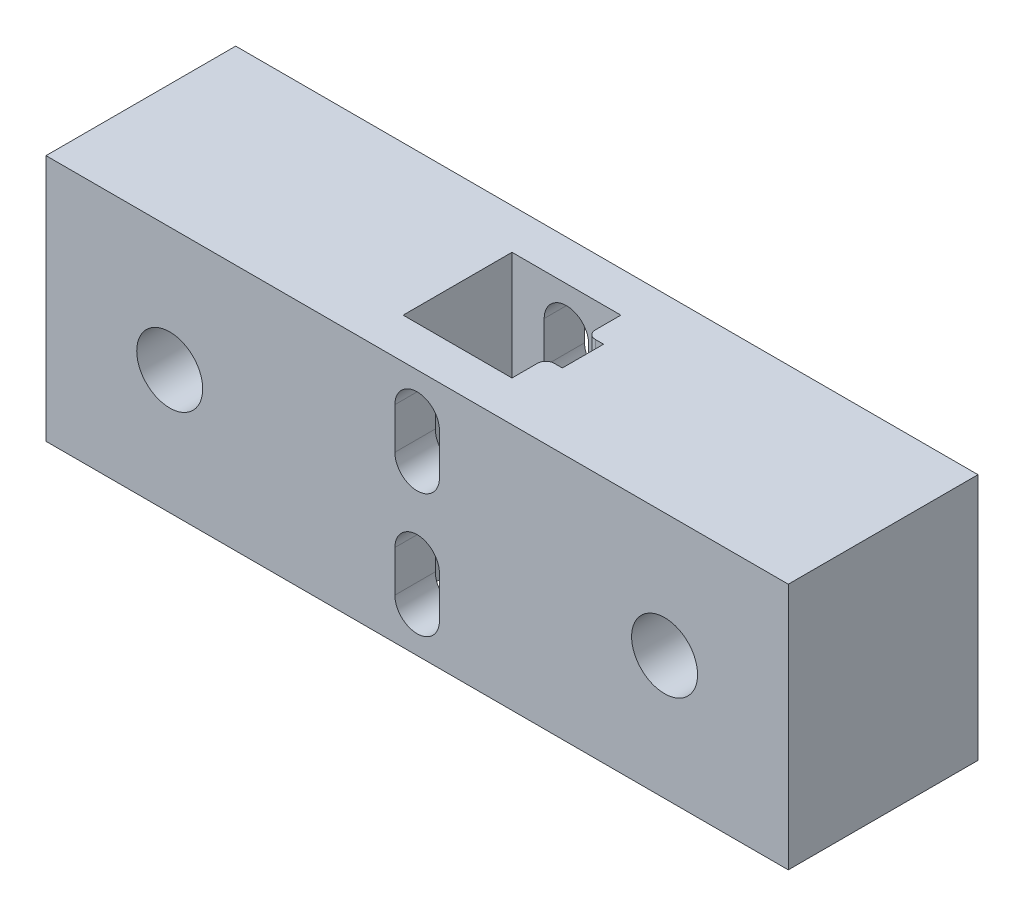
ISO-10303-21;
HEADER;
FILE_DESCRIPTION(('STEP AP214'),'2;1');
FILE_NAME('part.step','',(''),(''),'','','');
FILE_SCHEMA(('AUTOMOTIVE_DESIGN { 1 0 10303 214 1 1 1 1 }'));
ENDSEC;
DATA;
#1=APPLICATION_CONTEXT('core data for automotive mechanical design processes');
#2=APPLICATION_PROTOCOL_DEFINITION('international standard','automotive_design',2000,#1);
#3=PRODUCT_CONTEXT('',#1,'mechanical');
#4=PRODUCT('Part','Part','',(#3));
#5=PRODUCT_RELATED_PRODUCT_CATEGORY('part','',(#4));
#6=PRODUCT_DEFINITION_FORMATION('','',#4);
#7=PRODUCT_DEFINITION_CONTEXT('part definition',#1,'design');
#8=PRODUCT_DEFINITION('design','',#6,#7);
#9=PRODUCT_DEFINITION_SHAPE('','',#8);
#10=(LENGTH_UNIT() NAMED_UNIT(*) SI_UNIT(.MILLI.,.METRE.));
#11=(NAMED_UNIT(*) PLANE_ANGLE_UNIT() SI_UNIT($,.RADIAN.));
#12=(NAMED_UNIT(*) SI_UNIT($,.STERADIAN.) SOLID_ANGLE_UNIT());
#13=UNCERTAINTY_MEASURE_WITH_UNIT(LENGTH_MEASURE(1.E-05),#10,'distance_accuracy_value','');
#14=(GEOMETRIC_REPRESENTATION_CONTEXT(3) GLOBAL_UNCERTAINTY_ASSIGNED_CONTEXT((#13)) GLOBAL_UNIT_ASSIGNED_CONTEXT((#10,
#11,#12)) REPRESENTATION_CONTEXT('',''));
#15=CARTESIAN_POINT('',(0.,0.,0.));
#16=DIRECTION('',(0.,0.,1.));
#17=DIRECTION('',(1.,0.,0.));
#18=AXIS2_PLACEMENT_3D('',#15,#16,#17);
#19=CARTESIAN_POINT('',(0.,0.,23.));
#20=DIRECTION('',(0.,0.,1.));
#21=DIRECTION('',(1.,0.,0.));
#22=AXIS2_PLACEMENT_3D('',#19,#20,#21);
#23=PLANE('',#22);
#24=CARTESIAN_POINT('',(40.889968792194,-23.0911366711773,23.));
#25=DIRECTION('',(0.,0.,-1.));
#26=DIRECTION('',(-1.,0.,0.));
#27=AXIS2_PLACEMENT_3D('',#24,#25,#26);
#28=CIRCLE('',#27,2.69999999999999);
#29=CARTESIAN_POINT('',(43.589968792194,-23.0911366711773,23.));
#30=VERTEX_POINT('',#29);
#31=CARTESIAN_POINT('',(38.1899687921941,-23.0911366711773,23.));
#32=VERTEX_POINT('',#31);
#33=EDGE_CURVE('E303',#30,#32,#28,.T.);
#34=ORIENTED_EDGE('',*,*,#33,.T.);
#35=DIRECTION('',(0.,1.,0.));
#36=VECTOR('',#35,1.);
#37=CARTESIAN_POINT('',(38.1899687921941,-23.0911366711773,23.));
#38=LINE('',#37,#36);
#39=CARTESIAN_POINT('',(38.1899687921941,-18.0911366711773,23.));
#40=VERTEX_POINT('',#39);
#41=EDGE_CURVE('E314',#32,#40,#38,.T.);
#42=ORIENTED_EDGE('',*,*,#41,.T.);
#43=CARTESIAN_POINT('',(40.889968792194,-18.0911366711773,23.));
#44=DIRECTION('',(0.,0.,-1.));
#45=DIRECTION('',(-1.,0.,0.));
#46=AXIS2_PLACEMENT_3D('',#43,#44,#45);
#47=CIRCLE('',#46,2.69999999999999);
#48=CARTESIAN_POINT('',(43.589968792194,-18.0911366711773,23.));
#49=VERTEX_POINT('',#48);
#50=EDGE_CURVE('E311',#40,#49,#47,.T.);
#51=ORIENTED_EDGE('',*,*,#50,.T.);
#52=DIRECTION('',(0.,1.,0.));
#53=VECTOR('',#52,1.);
#54=CARTESIAN_POINT('',(43.589968792194,-23.0911366711773,23.));
#55=LINE('',#54,#53);
#56=EDGE_CURVE('E285',#30,#49,#55,.T.);
#57=ORIENTED_EDGE('',*,*,#56,.F.);
#58=EDGE_LOOP('',(#34,#42,#51,#57));
#59=FACE_BOUND('',#58,.T.);
#60=CARTESIAN_POINT('',(70.889968792194,-13.0911366711773,23.));
#61=DIRECTION('',(0.,0.,1.));
#62=DIRECTION('',(1.,0.,0.));
#63=AXIS2_PLACEMENT_3D('',#60,#61,#62);
#64=CIRCLE('',#63,4.00000000000001);
#65=CARTESIAN_POINT('',(74.8899687921941,-13.0911366711773,23.));
#66=VERTEX_POINT('',#65);
#67=EDGE_CURVE('E339',#66,#66,#64,.T.);
#68=ORIENTED_EDGE('',*,*,#67,.F.);
#69=EDGE_LOOP('',(#68));
#70=FACE_BOUND('',#69,.T.);
#71=DIRECTION('',(0.,-1.,0.));
#72=VECTOR('',#71,1.);
#73=CARTESIAN_POINT('',(-4.11003120780596,1.90886332882273,23.));
#74=LINE('',#73,#72);
#75=CARTESIAN_POINT('',(-4.11003120780596,1.90886332882273,23.));
#76=VERTEX_POINT('',#75);
#77=CARTESIAN_POINT('',(-4.11003120780596,-28.0911366711773,23.));
#78=VERTEX_POINT('',#77);
#79=EDGE_CURVE('E405',#76,#78,#74,.T.);
#80=ORIENTED_EDGE('',*,*,#79,.T.);
#81=DIRECTION('',(1.,0.,0.));
#82=VECTOR('',#81,1.);
#83=CARTESIAN_POINT('',(-4.11003120780596,-28.0911366711773,23.));
#84=LINE('',#83,#82);
#85=CARTESIAN_POINT('',(85.889968792194,-28.0911366711773,23.));
#86=VERTEX_POINT('',#85);
#87=EDGE_CURVE('E408',#78,#86,#84,.T.);
#88=ORIENTED_EDGE('',*,*,#87,.T.);
#89=DIRECTION('',(0.,1.,0.));
#90=VECTOR('',#89,1.);
#91=CARTESIAN_POINT('',(85.889968792194,1.90886332882273,23.));
#92=LINE('',#91,#90);
#93=CARTESIAN_POINT('',(85.889968792194,1.90886332882273,23.));
#94=VERTEX_POINT('',#93);
#95=EDGE_CURVE('E411',#86,#94,#92,.T.);
#96=ORIENTED_EDGE('',*,*,#95,.T.);
#97=DIRECTION('',(-1.,0.,0.));
#98=VECTOR('',#97,1.);
#99=CARTESIAN_POINT('',(-4.11003120780596,1.90886332882273,23.));
#100=LINE('',#99,#98);
#101=EDGE_CURVE('E413',#94,#76,#100,.T.);
#102=ORIENTED_EDGE('',*,*,#101,.T.);
#103=EDGE_LOOP('',(#80,#88,#96,#102));
#104=FACE_BOUND('',#103,.T.);
#105=CARTESIAN_POINT('',(10.889968792194,-13.0911366711773,23.));
#106=DIRECTION('',(0.,0.,-1.));
#107=DIRECTION('',(-1.,0.,0.));
#108=AXIS2_PLACEMENT_3D('',#105,#106,#107);
#109=CIRCLE('',#108,4.);
#110=CARTESIAN_POINT('',(6.88996879219403,-13.0911366711773,23.));
#111=VERTEX_POINT('',#110);
#112=EDGE_CURVE('E340',#111,#111,#109,.T.);
#113=ORIENTED_EDGE('',*,*,#112,.T.);
#114=EDGE_LOOP('',(#113));
#115=FACE_BOUND('',#114,.T.);
#116=DIRECTION('',(0.,-1.,0.));
#117=VECTOR('',#116,1.);
#118=CARTESIAN_POINT('',(43.589968792194,0.,23.));
#119=LINE('',#118,#117);
#120=CARTESIAN_POINT('',(43.589968792194,-3.09113667117727,23.));
#121=VERTEX_POINT('',#120);
#122=CARTESIAN_POINT('',(43.589968792194,-8.09113667117727,23.));
#123=VERTEX_POINT('',#122);
#124=EDGE_CURVE('E256',#121,#123,#119,.T.);
#125=ORIENTED_EDGE('',*,*,#124,.T.);
#126=CARTESIAN_POINT('',(40.889968792194,-8.09113667117727,23.));
#127=DIRECTION('',(0.,0.,-1.));
#128=DIRECTION('',(-1.,0.,0.));
#129=AXIS2_PLACEMENT_3D('',#126,#127,#128);
#130=CIRCLE('',#129,2.69999999999999);
#131=CARTESIAN_POINT('',(38.1899687921941,-8.09113667117727,23.));
#132=VERTEX_POINT('',#131);
#133=EDGE_CURVE('E242',#132,#123,#130,.F.);
#134=ORIENTED_EDGE('',*,*,#133,.F.);
#135=DIRECTION('',(0.,-1.,0.));
#136=VECTOR('',#135,1.);
#137=CARTESIAN_POINT('',(38.1899687921941,0.,23.));
#138=LINE('',#137,#136);
#139=CARTESIAN_POINT('',(38.1899687921941,-3.09113667117727,23.));
#140=VERTEX_POINT('',#139);
#141=EDGE_CURVE('E230',#140,#132,#138,.T.);
#142=ORIENTED_EDGE('',*,*,#141,.F.);
#143=CARTESIAN_POINT('',(40.889968792194,-3.09113667117727,23.));
#144=DIRECTION('',(0.,0.,-1.));
#145=DIRECTION('',(-1.,0.,0.));
#146=AXIS2_PLACEMENT_3D('',#143,#144,#145);
#147=CIRCLE('',#146,2.69999999999999);
#148=EDGE_CURVE('E241',#121,#140,#147,.F.);
#149=ORIENTED_EDGE('',*,*,#148,.F.);
#150=EDGE_LOOP('',(#125,#134,#142,#149));
#151=FACE_BOUND('',#150,.T.);
#152=ADVANCED_FACE('F35',(#59,#70,#104,#115,#151),#23,.T.);
#153=CARTESIAN_POINT('',(0.,0.,0.));
#154=DIRECTION('',(0.,0.,1.));
#155=DIRECTION('',(1.,0.,0.));
#156=AXIS2_PLACEMENT_3D('',#153,#154,#155);
#157=PLANE('',#156);
#158=CARTESIAN_POINT('',(10.889968792194,-13.0911366711773,0.));
#159=DIRECTION('',(0.,0.,-1.));
#160=DIRECTION('',(-1.,0.,0.));
#161=AXIS2_PLACEMENT_3D('',#158,#159,#160);
#162=CIRCLE('',#161,4.);
#163=CARTESIAN_POINT('',(6.88996879219403,-13.0911366711773,0.));
#164=VERTEX_POINT('',#163);
#165=EDGE_CURVE('E344',#164,#164,#162,.T.);
#166=ORIENTED_EDGE('',*,*,#165,.F.);
#167=EDGE_LOOP('',(#166));
#168=FACE_BOUND('',#167,.T.);
#169=CARTESIAN_POINT('',(70.889968792194,-13.0911366711773,0.));
#170=DIRECTION('',(0.,0.,1.));
#171=DIRECTION('',(1.,0.,0.));
#172=AXIS2_PLACEMENT_3D('',#169,#170,#171);
#173=CIRCLE('',#172,4.00000000000001);
#174=CARTESIAN_POINT('',(74.8899687921941,-13.0911366711773,0.));
#175=VERTEX_POINT('',#174);
#176=EDGE_CURVE('E347',#175,#175,#173,.T.);
#177=ORIENTED_EDGE('',*,*,#176,.T.);
#178=EDGE_LOOP('',(#177));
#179=FACE_BOUND('',#178,.T.);
#180=DIRECTION('',(0.,-1.,0.));
#181=VECTOR('',#180,1.);
#182=CARTESIAN_POINT('',(-4.11003120780596,1.90886332882273,0.));
#183=LINE('',#182,#181);
#184=CARTESIAN_POINT('',(-4.11003120780596,1.90886332882273,0.));
#185=VERTEX_POINT('',#184);
#186=CARTESIAN_POINT('',(-4.11003120780596,-28.0911366711773,0.));
#187=VERTEX_POINT('',#186);
#188=EDGE_CURVE('E390',#185,#187,#183,.T.);
#189=ORIENTED_EDGE('',*,*,#188,.F.);
#190=DIRECTION('',(-1.,0.,0.));
#191=VECTOR('',#190,1.);
#192=CARTESIAN_POINT('',(-4.11003120780596,1.90886332882273,0.));
#193=LINE('',#192,#191);
#194=CARTESIAN_POINT('',(85.889968792194,1.90886332882273,0.));
#195=VERTEX_POINT('',#194);
#196=EDGE_CURVE('E409',#195,#185,#193,.T.);
#197=ORIENTED_EDGE('',*,*,#196,.F.);
#198=DIRECTION('',(0.,1.,0.));
#199=VECTOR('',#198,1.);
#200=CARTESIAN_POINT('',(85.889968792194,1.90886332882273,0.));
#201=LINE('',#200,#199);
#202=CARTESIAN_POINT('',(85.889968792194,-28.0911366711773,0.));
#203=VERTEX_POINT('',#202);
#204=EDGE_CURVE('E420',#203,#195,#201,.T.);
#205=ORIENTED_EDGE('',*,*,#204,.F.);
#206=DIRECTION('',(1.,0.,0.));
#207=VECTOR('',#206,1.);
#208=CARTESIAN_POINT('',(-4.11003120780596,-28.0911366711773,0.));
#209=LINE('',#208,#207);
#210=EDGE_CURVE('E418',#187,#203,#209,.T.);
#211=ORIENTED_EDGE('',*,*,#210,.F.);
#212=EDGE_LOOP('',(#189,#197,#205,#211));
#213=FACE_BOUND('',#212,.T.);
#214=DIRECTION('',(0.,1.,0.));
#215=VECTOR('',#214,1.);
#216=CARTESIAN_POINT('',(38.1899687921941,-23.0911366711773,0.));
#217=LINE('',#216,#215);
#218=CARTESIAN_POINT('',(38.1899687921941,-23.0911366711773,0.));
#219=VERTEX_POINT('',#218);
#220=CARTESIAN_POINT('',(38.1899687921941,-18.0911366711773,0.));
#221=VERTEX_POINT('',#220);
#222=EDGE_CURVE('E306',#219,#221,#217,.T.);
#223=ORIENTED_EDGE('',*,*,#222,.F.);
#224=CARTESIAN_POINT('',(40.889968792194,-23.0911366711773,0.));
#225=DIRECTION('',(0.,0.,-1.));
#226=DIRECTION('',(-1.,0.,0.));
#227=AXIS2_PLACEMENT_3D('',#224,#225,#226);
#228=CIRCLE('',#227,2.69999999999999);
#229=CARTESIAN_POINT('',(43.589968792194,-23.0911366711773,0.));
#230=VERTEX_POINT('',#229);
#231=EDGE_CURVE('E269',#230,#219,#228,.T.);
#232=ORIENTED_EDGE('',*,*,#231,.F.);
#233=DIRECTION('',(0.,1.,0.));
#234=VECTOR('',#233,1.);
#235=CARTESIAN_POINT('',(43.589968792194,-23.0911366711773,0.));
#236=LINE('',#235,#234);
#237=CARTESIAN_POINT('',(43.589968792194,-18.0911366711773,0.));
#238=VERTEX_POINT('',#237);
#239=EDGE_CURVE('E299',#230,#238,#236,.T.);
#240=ORIENTED_EDGE('',*,*,#239,.T.);
#241=CARTESIAN_POINT('',(40.889968792194,-18.0911366711773,0.));
#242=DIRECTION('',(0.,0.,-1.));
#243=DIRECTION('',(-1.,0.,0.));
#244=AXIS2_PLACEMENT_3D('',#241,#242,#243);
#245=CIRCLE('',#244,2.69999999999999);
#246=EDGE_CURVE('E302',#221,#238,#245,.T.);
#247=ORIENTED_EDGE('',*,*,#246,.F.);
#248=EDGE_LOOP('',(#223,#232,#240,#247));
#249=FACE_BOUND('',#248,.T.);
#250=CARTESIAN_POINT('',(40.889968792194,-8.09113667117727,0.));
#251=DIRECTION('',(0.,0.,-1.));
#252=DIRECTION('',(-1.,0.,0.));
#253=AXIS2_PLACEMENT_3D('',#250,#251,#252);
#254=CIRCLE('',#253,2.69999999999999);
#255=CARTESIAN_POINT('',(38.1899687921941,-8.09113667117727,0.));
#256=VERTEX_POINT('',#255);
#257=CARTESIAN_POINT('',(43.589968792194,-8.09113667117727,0.));
#258=VERTEX_POINT('',#257);
#259=EDGE_CURVE('E265',#256,#258,#254,.F.);
#260=ORIENTED_EDGE('',*,*,#259,.T.);
#261=DIRECTION('',(0.,-1.,0.));
#262=VECTOR('',#261,1.);
#263=CARTESIAN_POINT('',(43.589968792194,0.,0.));
#264=LINE('',#263,#262);
#265=CARTESIAN_POINT('',(43.589968792194,-3.09113667117727,0.));
#266=VERTEX_POINT('',#265);
#267=EDGE_CURVE('E257',#266,#258,#264,.T.);
#268=ORIENTED_EDGE('',*,*,#267,.F.);
#269=CARTESIAN_POINT('',(40.889968792194,-3.09113667117727,0.));
#270=DIRECTION('',(0.,0.,-1.));
#271=DIRECTION('',(-1.,0.,0.));
#272=AXIS2_PLACEMENT_3D('',#269,#270,#271);
#273=CIRCLE('',#272,2.69999999999999);
#274=CARTESIAN_POINT('',(38.1899687921941,-3.09113667117727,0.));
#275=VERTEX_POINT('',#274);
#276=EDGE_CURVE('E260',#266,#275,#273,.F.);
#277=ORIENTED_EDGE('',*,*,#276,.T.);
#278=DIRECTION('',(0.,-1.,0.));
#279=VECTOR('',#278,1.);
#280=CARTESIAN_POINT('',(38.1899687921941,0.,0.));
#281=LINE('',#280,#279);
#282=EDGE_CURVE('E268',#275,#256,#281,.T.);
#283=ORIENTED_EDGE('',*,*,#282,.T.);
#284=EDGE_LOOP('',(#260,#268,#277,#283));
#285=FACE_BOUND('',#284,.T.);
#286=ADVANCED_FACE('F516',(#168,#179,#213,#249,#285),#157,.F.);
#287=CARTESIAN_POINT('',(0.,-28.0911366711773,4.89999999999999));
#288=DIRECTION('',(0.,0.,-1.));
#289=DIRECTION('',(-1.,0.,0.));
#290=AXIS2_PLACEMENT_3D('',#287,#288,#289);
#291=PLANE('',#290);
#292=DIRECTION('',(-1.,0.,0.));
#293=VECTOR('',#292,1.);
#294=CARTESIAN_POINT('',(0.,1.90886332882273,4.89999999999999));
#295=LINE('',#294,#293);
#296=CARTESIAN_POINT('',(47.489968792194,1.90886332882273,4.89999999999999));
#297=VERTEX_POINT('',#296);
#298=CARTESIAN_POINT('',(34.289968792194,1.90886332882273,4.89999999999999));
#299=VERTEX_POINT('',#298);
#300=EDGE_CURVE('E343',#297,#299,#295,.T.);
#301=ORIENTED_EDGE('',*,*,#300,.T.);
#302=DIRECTION('',(0.,1.,0.));
#303=VECTOR('',#302,1.);
#304=CARTESIAN_POINT('',(34.289968792194,-28.0911366711773,4.89999999999999));
#305=LINE('',#304,#303);
#306=CARTESIAN_POINT('',(34.289968792194,-28.0911366711773,4.89999999999999));
#307=VERTEX_POINT('',#306);
#308=EDGE_CURVE('E402',#307,#299,#305,.T.);
#309=ORIENTED_EDGE('',*,*,#308,.F.);
#310=DIRECTION('',(-1.,0.,0.));
#311=VECTOR('',#310,1.);
#312=CARTESIAN_POINT('',(0.,-28.0911366711773,4.89999999999999));
#313=LINE('',#312,#311);
#314=CARTESIAN_POINT('',(47.489968792194,-28.0911366711773,4.89999999999999));
#315=VERTEX_POINT('',#314);
#316=EDGE_CURVE('E352',#315,#307,#313,.T.);
#317=ORIENTED_EDGE('',*,*,#316,.F.);
#318=DIRECTION('',(0.,1.,0.));
#319=VECTOR('',#318,1.);
#320=CARTESIAN_POINT('',(47.489968792194,-28.0911366711773,4.89999999999999));
#321=LINE('',#320,#319);
#322=EDGE_CURVE('E388',#315,#297,#321,.T.);
#323=ORIENTED_EDGE('',*,*,#322,.T.);
#324=EDGE_LOOP('',(#301,#309,#317,#323));
#325=FACE_BOUND('',#324,.T.);
#326=DIRECTION('',(0.,1.,0.));
#327=VECTOR('',#326,1.);
#328=CARTESIAN_POINT('',(43.589968792194,-28.0911366711773,4.89999999999999));
#329=LINE('',#328,#327);
#330=CARTESIAN_POINT('',(43.589968792194,-23.0911366711773,4.89999999999999));
#331=VERTEX_POINT('',#330);
#332=CARTESIAN_POINT('',(43.589968792194,-18.0911366711773,4.89999999999999));
#333=VERTEX_POINT('',#332);
#334=EDGE_CURVE('E324',#331,#333,#329,.T.);
#335=ORIENTED_EDGE('',*,*,#334,.F.);
#336=CARTESIAN_POINT('',(40.889968792194,-23.0911366711773,4.89999999999999));
#337=DIRECTION('',(0.,0.,-1.));
#338=DIRECTION('',(-1.,0.,0.));
#339=AXIS2_PLACEMENT_3D('',#336,#337,#338);
#340=CIRCLE('',#339,2.69999999999999);
#341=CARTESIAN_POINT('',(38.1899687921941,-23.0911366711773,4.89999999999999));
#342=VERTEX_POINT('',#341);
#343=EDGE_CURVE('E326',#331,#342,#340,.T.);
#344=ORIENTED_EDGE('',*,*,#343,.T.);
#345=DIRECTION('',(0.,1.,0.));
#346=VECTOR('',#345,1.);
#347=CARTESIAN_POINT('',(38.1899687921941,-28.0911366711773,4.89999999999999));
#348=LINE('',#347,#346);
#349=CARTESIAN_POINT('',(38.1899687921941,-18.0911366711773,4.89999999999999));
#350=VERTEX_POINT('',#349);
#351=EDGE_CURVE('E276',#342,#350,#348,.T.);
#352=ORIENTED_EDGE('',*,*,#351,.T.);
#353=CARTESIAN_POINT('',(40.889968792194,-18.0911366711773,4.89999999999999));
#354=DIRECTION('',(0.,0.,-1.));
#355=DIRECTION('',(-1.,0.,0.));
#356=AXIS2_PLACEMENT_3D('',#353,#354,#355);
#357=CIRCLE('',#356,2.69999999999999);
#358=EDGE_CURVE('E321',#350,#333,#357,.T.);
#359=ORIENTED_EDGE('',*,*,#358,.T.);
#360=EDGE_LOOP('',(#335,#344,#352,#359));
#361=FACE_BOUND('',#360,.T.);
#362=CARTESIAN_POINT('',(40.889968792194,-8.09113667117727,4.89999999999999));
#363=DIRECTION('',(0.,0.,-1.));
#364=DIRECTION('',(-1.,0.,0.));
#365=AXIS2_PLACEMENT_3D('',#362,#363,#364);
#366=CIRCLE('',#365,2.69999999999999);
#367=CARTESIAN_POINT('',(38.1899687921941,-8.09113667117727,4.89999999999999));
#368=VERTEX_POINT('',#367);
#369=CARTESIAN_POINT('',(43.589968792194,-8.09113667117727,4.89999999999999));
#370=VERTEX_POINT('',#369);
#371=EDGE_CURVE('E337',#368,#370,#366,.F.);
#372=ORIENTED_EDGE('',*,*,#371,.F.);
#373=DIRECTION('',(0.,-1.,0.));
#374=VECTOR('',#373,1.);
#375=CARTESIAN_POINT('',(38.1899687921941,-28.0911366711773,4.89999999999999));
#376=LINE('',#375,#374);
#377=CARTESIAN_POINT('',(38.1899687921941,-3.09113667117727,4.89999999999999));
#378=VERTEX_POINT('',#377);
#379=EDGE_CURVE('E329',#378,#368,#376,.T.);
#380=ORIENTED_EDGE('',*,*,#379,.F.);
#381=CARTESIAN_POINT('',(40.889968792194,-3.09113667117727,4.89999999999999));
#382=DIRECTION('',(0.,0.,-1.));
#383=DIRECTION('',(-1.,0.,0.));
#384=AXIS2_PLACEMENT_3D('',#381,#382,#383);
#385=CIRCLE('',#384,2.69999999999999);
#386=CARTESIAN_POINT('',(43.589968792194,-3.09113667117727,4.89999999999999));
#387=VERTEX_POINT('',#386);
#388=EDGE_CURVE('E331',#387,#378,#385,.F.);
#389=ORIENTED_EDGE('',*,*,#388,.F.);
#390=DIRECTION('',(0.,-1.,0.));
#391=VECTOR('',#390,1.);
#392=CARTESIAN_POINT('',(43.589968792194,-28.0911366711773,4.89999999999999));
#393=LINE('',#392,#391);
#394=EDGE_CURVE('E334',#387,#370,#393,.T.);
#395=ORIENTED_EDGE('',*,*,#394,.T.);
#396=EDGE_LOOP('',(#372,#380,#389,#395));
#397=FACE_BOUND('',#396,.T.);
#398=ADVANCED_FACE('F497',(#325,#361,#397),#291,.F.);
#399=CARTESIAN_POINT('',(0.,-28.0911366711773,18.1));
#400=DIRECTION('',(0.,0.,-1.));
#401=DIRECTION('',(-1.,0.,0.));
#402=AXIS2_PLACEMENT_3D('',#399,#400,#401);
#403=PLANE('',#402);
#404=CARTESIAN_POINT('',(40.889968792194,-23.0911366711773,18.1));
#405=DIRECTION('',(0.,0.,-1.));
#406=DIRECTION('',(-1.,0.,0.));
#407=AXIS2_PLACEMENT_3D('',#404,#405,#406);
#408=CIRCLE('',#407,2.69999999999999);
#409=CARTESIAN_POINT('',(43.589968792194,-23.0911366711773,18.1));
#410=VERTEX_POINT('',#409);
#411=CARTESIAN_POINT('',(38.1899687921941,-23.0911366711773,18.1));
#412=VERTEX_POINT('',#411);
#413=EDGE_CURVE('E441',#410,#412,#408,.T.);
#414=ORIENTED_EDGE('',*,*,#413,.F.);
#415=DIRECTION('',(0.,1.,0.));
#416=VECTOR('',#415,1.);
#417=CARTESIAN_POINT('',(43.589968792194,-28.0911366711773,18.1));
#418=LINE('',#417,#416);
#419=CARTESIAN_POINT('',(43.589968792194,-18.0911366711773,18.1));
#420=VERTEX_POINT('',#419);
#421=EDGE_CURVE('E438',#410,#420,#418,.T.);
#422=ORIENTED_EDGE('',*,*,#421,.T.);
#423=CARTESIAN_POINT('',(40.889968792194,-18.0911366711773,18.1));
#424=DIRECTION('',(0.,0.,-1.));
#425=DIRECTION('',(-1.,0.,0.));
#426=AXIS2_PLACEMENT_3D('',#423,#424,#425);
#427=CIRCLE('',#426,2.69999999999999);
#428=CARTESIAN_POINT('',(38.1899687921941,-18.0911366711773,18.1));
#429=VERTEX_POINT('',#428);
#430=EDGE_CURVE('E436',#429,#420,#427,.T.);
#431=ORIENTED_EDGE('',*,*,#430,.F.);
#432=DIRECTION('',(0.,1.,0.));
#433=VECTOR('',#432,1.);
#434=CARTESIAN_POINT('',(38.1899687921941,-28.0911366711773,18.1));
#435=LINE('',#434,#433);
#436=EDGE_CURVE('E434',#412,#429,#435,.T.);
#437=ORIENTED_EDGE('',*,*,#436,.F.);
#438=EDGE_LOOP('',(#414,#422,#431,#437));
#439=FACE_BOUND('',#438,.T.);
#440=DIRECTION('',(-1.,0.,0.));
#441=VECTOR('',#440,1.);
#442=CARTESIAN_POINT('',(0.,1.90886332882273,18.1));
#443=LINE('',#442,#441);
#444=CARTESIAN_POINT('',(47.489968792194,1.90886332882273,18.1));
#445=VERTEX_POINT('',#444);
#446=CARTESIAN_POINT('',(34.289968792194,1.90886332882273,18.1));
#447=VERTEX_POINT('',#446);
#448=EDGE_CURVE('E376',#445,#447,#443,.T.);
#449=ORIENTED_EDGE('',*,*,#448,.F.);
#450=DIRECTION('',(0.,1.,0.));
#451=VECTOR('',#450,1.);
#452=CARTESIAN_POINT('',(47.489968792194,-28.0911366711773,18.1));
#453=LINE('',#452,#451);
#454=CARTESIAN_POINT('',(47.489968792194,-28.0911366711773,18.1));
#455=VERTEX_POINT('',#454);
#456=EDGE_CURVE('E397',#455,#445,#453,.T.);
#457=ORIENTED_EDGE('',*,*,#456,.F.);
#458=DIRECTION('',(-1.,0.,0.));
#459=VECTOR('',#458,1.);
#460=CARTESIAN_POINT('',(0.,-28.0911366711773,18.1));
#461=LINE('',#460,#459);
#462=CARTESIAN_POINT('',(34.289968792194,-28.0911366711773,18.1));
#463=VERTEX_POINT('',#462);
#464=EDGE_CURVE('E359',#455,#463,#461,.T.);
#465=ORIENTED_EDGE('',*,*,#464,.T.);
#466=DIRECTION('',(0.,1.,0.));
#467=VECTOR('',#466,1.);
#468=CARTESIAN_POINT('',(34.289968792194,-28.0911366711773,18.1));
#469=LINE('',#468,#467);
#470=EDGE_CURVE('E400',#463,#447,#469,.T.);
#471=ORIENTED_EDGE('',*,*,#470,.T.);
#472=EDGE_LOOP('',(#449,#457,#465,#471));
#473=FACE_BOUND('',#472,.T.);
#474=DIRECTION('',(0.,-1.,0.));
#475=VECTOR('',#474,1.);
#476=CARTESIAN_POINT('',(38.1899687921941,-28.0911366711773,18.1));
#477=LINE('',#476,#475);
#478=CARTESIAN_POINT('',(38.1899687921941,-3.09113667117727,18.1));
#479=VERTEX_POINT('',#478);
#480=CARTESIAN_POINT('',(38.1899687921941,-8.09113667117727,18.1));
#481=VERTEX_POINT('',#480);
#482=EDGE_CURVE('E444',#479,#481,#477,.T.);
#483=ORIENTED_EDGE('',*,*,#482,.T.);
#484=CARTESIAN_POINT('',(40.889968792194,-8.09113667117727,18.1));
#485=DIRECTION('',(0.,0.,-1.));
#486=DIRECTION('',(-1.,0.,0.));
#487=AXIS2_PLACEMENT_3D('',#484,#485,#486);
#488=CIRCLE('',#487,2.69999999999999);
#489=CARTESIAN_POINT('',(43.589968792194,-8.09113667117727,18.1));
#490=VERTEX_POINT('',#489);
#491=EDGE_CURVE('E249',#481,#490,#488,.F.);
#492=ORIENTED_EDGE('',*,*,#491,.T.);
#493=DIRECTION('',(0.,-1.,0.));
#494=VECTOR('',#493,1.);
#495=CARTESIAN_POINT('',(43.589968792194,-28.0911366711773,18.1));
#496=LINE('',#495,#494);
#497=CARTESIAN_POINT('',(43.589968792194,-3.09113667117727,18.1));
#498=VERTEX_POINT('',#497);
#499=EDGE_CURVE('E449',#498,#490,#496,.T.);
#500=ORIENTED_EDGE('',*,*,#499,.F.);
#501=CARTESIAN_POINT('',(40.889968792194,-3.09113667117727,18.1));
#502=DIRECTION('',(0.,0.,-1.));
#503=DIRECTION('',(-1.,0.,0.));
#504=AXIS2_PLACEMENT_3D('',#501,#502,#503);
#505=CIRCLE('',#504,2.69999999999999);
#506=EDGE_CURVE('E446',#498,#479,#505,.F.);
#507=ORIENTED_EDGE('',*,*,#506,.T.);
#508=EDGE_LOOP('',(#483,#492,#500,#507));
#509=FACE_BOUND('',#508,.T.);
#510=ADVANCED_FACE('F507',(#439,#473,#509),#403,.T.);
#511=CARTESIAN_POINT('',(-4.11003120780596,1.90886332882273,23.));
#512=DIRECTION('',(1.,0.,0.));
#513=DIRECTION('',(0.,1.,0.));
#514=AXIS2_PLACEMENT_3D('',#511,#512,#513);
#515=PLANE('',#514);
#516=ORIENTED_EDGE('',*,*,#188,.T.);
#517=DIRECTION('',(0.,0.,-1.));
#518=VECTOR('',#517,1.);
#519=CARTESIAN_POINT('',(-4.11003120780596,-28.0911366711773,23.));
#520=LINE('',#519,#518);
#521=EDGE_CURVE('E431',#78,#187,#520,.T.);
#522=ORIENTED_EDGE('',*,*,#521,.F.);
#523=ORIENTED_EDGE('',*,*,#79,.F.);
#524=DIRECTION('',(0.,0.,-1.));
#525=VECTOR('',#524,1.);
#526=CARTESIAN_POINT('',(-4.11003120780596,1.90886332882273,23.));
#527=LINE('',#526,#525);
#528=EDGE_CURVE('E415',#76,#185,#527,.T.);
#529=ORIENTED_EDGE('',*,*,#528,.T.);
#530=EDGE_LOOP('',(#516,#522,#523,#529));
#531=FACE_BOUND('',#530,.T.);
#532=ADVANCED_FACE('F536',(#531),#515,.F.);
#533=CARTESIAN_POINT('',(-4.11003120780596,-28.0911366711773,23.));
#534=DIRECTION('',(0.,1.,0.));
#535=DIRECTION('',(0.,0.,1.));
#536=AXIS2_PLACEMENT_3D('',#533,#534,#535);
#537=PLANE('',#536);
#538=DIRECTION('',(1.,0.,0.));
#539=VECTOR('',#538,1.);
#540=CARTESIAN_POINT('',(0.,-28.0911366711773,8.99999999999999));
#541=LINE('',#540,#539);
#542=CARTESIAN_POINT('',(48.489968792194,-28.0911366711773,8.99999999999999));
#543=VERTEX_POINT('',#542);
#544=CARTESIAN_POINT('',(49.489968792194,-28.0911366711773,8.99999999999999));
#545=VERTEX_POINT('',#544);
#546=EDGE_CURVE('E370',#543,#545,#541,.T.);
#547=ORIENTED_EDGE('',*,*,#546,.F.);
#548=CARTESIAN_POINT('',(48.489968792194,-28.0911366711773,7.99999999999999));
#549=DIRECTION('',(0.,1.,0.));
#550=DIRECTION('',(0.,0.,1.));
#551=AXIS2_PLACEMENT_3D('',#548,#549,#550);
#552=CIRCLE('',#551,1.);
#553=CARTESIAN_POINT('',(47.489968792194,-28.0911366711773,7.99999999999999));
#554=VERTEX_POINT('',#553);
#555=EDGE_CURVE('E462',#543,#554,#552,.F.);
#556=ORIENTED_EDGE('',*,*,#555,.T.);
#557=DIRECTION('',(0.,0.,1.));
#558=VECTOR('',#557,1.);
#559=CARTESIAN_POINT('',(47.489968792194,-28.0911366711773,0.));
#560=LINE('',#559,#558);
#561=EDGE_CURVE('E365',#315,#554,#560,.T.);
#562=ORIENTED_EDGE('',*,*,#561,.F.);
#563=ORIENTED_EDGE('',*,*,#316,.T.);
#564=DIRECTION('',(0.,0.,1.));
#565=VECTOR('',#564,1.);
#566=CARTESIAN_POINT('',(34.289968792194,-28.0911366711773,0.));
#567=LINE('',#566,#565);
#568=EDGE_CURVE('E355',#307,#463,#567,.T.);
#569=ORIENTED_EDGE('',*,*,#568,.T.);
#570=ORIENTED_EDGE('',*,*,#464,.F.);
#571=CARTESIAN_POINT('',(47.489968792194,-28.0911366711773,15.));
#572=VERTEX_POINT('',#571);
#573=EDGE_CURVE('E362',#572,#455,#560,.T.);
#574=ORIENTED_EDGE('',*,*,#573,.F.);
#575=CARTESIAN_POINT('',(48.489968792194,-28.0911366711773,15.));
#576=DIRECTION('',(0.,1.,0.));
#577=DIRECTION('',(0.,0.,1.));
#578=AXIS2_PLACEMENT_3D('',#575,#576,#577);
#579=CIRCLE('',#578,1.);
#580=CARTESIAN_POINT('',(48.489968792194,-28.0911366711773,14.));
#581=VERTEX_POINT('',#580);
#582=EDGE_CURVE('E50',#572,#581,#579,.F.);
#583=ORIENTED_EDGE('',*,*,#582,.T.);
#584=DIRECTION('',(1.,0.,0.));
#585=VECTOR('',#584,1.);
#586=CARTESIAN_POINT('',(0.,-28.0911366711773,13.9999999999999));
#587=LINE('',#586,#585);
#588=CARTESIAN_POINT('',(49.489968792194,-28.0911366711773,14.));
#589=VERTEX_POINT('',#588);
#590=EDGE_CURVE('E364',#581,#589,#587,.T.);
#591=ORIENTED_EDGE('',*,*,#590,.T.);
#592=DIRECTION('',(0.,0.,-1.));
#593=VECTOR('',#592,1.);
#594=CARTESIAN_POINT('',(49.489968792194,-28.0911366711773,0.));
#595=LINE('',#594,#593);
#596=EDGE_CURVE('E367',#589,#545,#595,.T.);
#597=ORIENTED_EDGE('',*,*,#596,.T.);
#598=EDGE_LOOP('',(#547,#556,#562,#563,#569,#570,#574,#583,#591,#597));
#599=FACE_BOUND('',#598,.T.);
#600=ORIENTED_EDGE('',*,*,#210,.T.);
#601=DIRECTION('',(0.,0.,-1.));
#602=VECTOR('',#601,1.);
#603=CARTESIAN_POINT('',(85.889968792194,-28.0911366711773,23.));
#604=LINE('',#603,#602);
#605=EDGE_CURVE('E428',#86,#203,#604,.T.);
#606=ORIENTED_EDGE('',*,*,#605,.F.);
#607=ORIENTED_EDGE('',*,*,#87,.F.);
#608=ORIENTED_EDGE('',*,*,#521,.T.);
#609=EDGE_LOOP('',(#600,#606,#607,#608));
#610=FACE_BOUND('',#609,.T.);
#611=ADVANCED_FACE('F481',(#599,#610),#537,.F.);
#612=CARTESIAN_POINT('',(85.889968792194,1.90886332882273,23.));
#613=DIRECTION('',(-1.,0.,0.));
#614=DIRECTION('',(0.,0.,1.));
#615=AXIS2_PLACEMENT_3D('',#612,#613,#614);
#616=PLANE('',#615);
#617=ORIENTED_EDGE('',*,*,#204,.T.);
#618=DIRECTION('',(0.,0.,-1.));
#619=VECTOR('',#618,1.);
#620=CARTESIAN_POINT('',(85.889968792194,1.90886332882273,23.));
#621=LINE('',#620,#619);
#622=EDGE_CURVE('E425',#94,#195,#621,.T.);
#623=ORIENTED_EDGE('',*,*,#622,.F.);
#624=ORIENTED_EDGE('',*,*,#95,.F.);
#625=ORIENTED_EDGE('',*,*,#605,.T.);
#626=EDGE_LOOP('',(#617,#623,#624,#625));
#627=FACE_BOUND('',#626,.T.);
#628=ADVANCED_FACE('F530',(#627),#616,.F.);
#629=CARTESIAN_POINT('',(-4.11003120780596,1.90886332882273,23.));
#630=DIRECTION('',(0.,-1.,0.));
#631=DIRECTION('',(0.,0.,-1.));
#632=AXIS2_PLACEMENT_3D('',#629,#630,#631);
#633=PLANE('',#632);
#634=DIRECTION('',(0.,0.,1.));
#635=VECTOR('',#634,1.);
#636=CARTESIAN_POINT('',(47.489968792194,1.90886332882273,0.));
#637=LINE('',#636,#635);
#638=CARTESIAN_POINT('',(47.489968792194,1.90886332882273,7.99999999999999));
#639=VERTEX_POINT('',#638);
#640=EDGE_CURVE('E356',#297,#639,#637,.T.);
#641=ORIENTED_EDGE('',*,*,#640,.T.);
#642=CARTESIAN_POINT('',(48.489968792194,1.90886332882273,7.99999999999999));
#643=DIRECTION('',(0.,-1.,0.));
#644=DIRECTION('',(0.,0.,-1.));
#645=AXIS2_PLACEMENT_3D('',#642,#643,#644);
#646=CIRCLE('',#645,1.);
#647=CARTESIAN_POINT('',(48.489968792194,1.90886332882273,8.99999999999999));
#648=VERTEX_POINT('',#647);
#649=EDGE_CURVE('E457',#639,#648,#646,.F.);
#650=ORIENTED_EDGE('',*,*,#649,.T.);
#651=DIRECTION('',(1.,0.,0.));
#652=VECTOR('',#651,1.);
#653=CARTESIAN_POINT('',(0.,1.90886332882273,8.99999999999999));
#654=LINE('',#653,#652);
#655=CARTESIAN_POINT('',(49.489968792194,1.90886332882273,8.99999999999999));
#656=VERTEX_POINT('',#655);
#657=EDGE_CURVE('E386',#648,#656,#654,.T.);
#658=ORIENTED_EDGE('',*,*,#657,.T.);
#659=DIRECTION('',(0.,0.,-1.));
#660=VECTOR('',#659,1.);
#661=CARTESIAN_POINT('',(49.489968792194,1.90886332882273,0.));
#662=LINE('',#661,#660);
#663=CARTESIAN_POINT('',(49.489968792194,1.90886332882273,14.));
#664=VERTEX_POINT('',#663);
#665=EDGE_CURVE('E383',#664,#656,#662,.T.);
#666=ORIENTED_EDGE('',*,*,#665,.F.);
#667=DIRECTION('',(1.,0.,0.));
#668=VECTOR('',#667,1.);
#669=CARTESIAN_POINT('',(0.,1.90886332882273,13.9999999999999));
#670=LINE('',#669,#668);
#671=CARTESIAN_POINT('',(48.489968792194,1.90886332882273,14.));
#672=VERTEX_POINT('',#671);
#673=EDGE_CURVE('E381',#672,#664,#670,.T.);
#674=ORIENTED_EDGE('',*,*,#673,.F.);
#675=CARTESIAN_POINT('',(48.489968792194,1.90886332882273,15.));
#676=DIRECTION('',(0.,-1.,0.));
#677=DIRECTION('',(0.,0.,-1.));
#678=AXIS2_PLACEMENT_3D('',#675,#676,#677);
#679=CIRCLE('',#678,1.);
#680=CARTESIAN_POINT('',(47.489968792194,1.90886332882273,15.));
#681=VERTEX_POINT('',#680);
#682=EDGE_CURVE('E455',#672,#681,#679,.F.);
#683=ORIENTED_EDGE('',*,*,#682,.T.);
#684=EDGE_CURVE('E379',#681,#445,#637,.T.);
#685=ORIENTED_EDGE('',*,*,#684,.T.);
#686=ORIENTED_EDGE('',*,*,#448,.T.);
#687=DIRECTION('',(0.,0.,1.));
#688=VECTOR('',#687,1.);
#689=CARTESIAN_POINT('',(34.289968792194,1.90886332882273,0.));
#690=LINE('',#689,#688);
#691=EDGE_CURVE('E373',#299,#447,#690,.T.);
#692=ORIENTED_EDGE('',*,*,#691,.F.);
#693=ORIENTED_EDGE('',*,*,#300,.F.);
#694=EDGE_LOOP('',(#641,#650,#658,#666,#674,#683,#685,#686,#692,#693));
#695=FACE_BOUND('',#694,.T.);
#696=ORIENTED_EDGE('',*,*,#196,.T.);
#697=ORIENTED_EDGE('',*,*,#528,.F.);
#698=ORIENTED_EDGE('',*,*,#101,.F.);
#699=ORIENTED_EDGE('',*,*,#622,.T.);
#700=EDGE_LOOP('',(#696,#697,#698,#699));
#701=FACE_BOUND('',#700,.T.);
#702=ADVANCED_FACE('F473',(#695,#701),#633,.F.);
#703=CARTESIAN_POINT('',(47.489968792194,-28.0911366711773,0.));
#704=DIRECTION('',(-1.,0.,0.));
#705=DIRECTION('',(0.,0.,1.));
#706=AXIS2_PLACEMENT_3D('',#703,#704,#705);
#707=PLANE('',#706);
#708=ORIENTED_EDGE('',*,*,#561,.T.);
#709=DIRECTION('',(0.,1.,0.));
#710=VECTOR('',#709,1.);
#711=CARTESIAN_POINT('',(47.489968792194,-28.0911366711773,7.99999999999999));
#712=LINE('',#711,#710);
#713=EDGE_CURVE('E452',#554,#639,#712,.T.);
#714=ORIENTED_EDGE('',*,*,#713,.T.);
#715=ORIENTED_EDGE('',*,*,#640,.F.);
#716=ORIENTED_EDGE('',*,*,#322,.F.);
#717=EDGE_LOOP('',(#708,#714,#715,#716));
#718=FACE_BOUND('',#717,.T.);
#719=ADVANCED_FACE('F493',(#718),#707,.T.);
#720=CARTESIAN_POINT('',(0.,-28.0911366711773,8.99999999999999));
#721=DIRECTION('',(0.,0.,1.));
#722=DIRECTION('',(1.,0.,0.));
#723=AXIS2_PLACEMENT_3D('',#720,#721,#722);
#724=PLANE('',#723);
#725=ORIENTED_EDGE('',*,*,#657,.F.);
#726=DIRECTION('',(0.,1.,0.));
#727=VECTOR('',#726,1.);
#728=CARTESIAN_POINT('',(48.489968792194,-28.0911366711773,8.99999999999999));
#729=LINE('',#728,#727);
#730=EDGE_CURVE('E459',#648,#543,#729,.F.);
#731=ORIENTED_EDGE('',*,*,#730,.T.);
#732=ORIENTED_EDGE('',*,*,#546,.T.);
#733=DIRECTION('',(0.,1.,0.));
#734=VECTOR('',#733,1.);
#735=CARTESIAN_POINT('',(49.489968792194,-28.0911366711773,8.99999999999999));
#736=LINE('',#735,#734);
#737=EDGE_CURVE('E391',#545,#656,#736,.T.);
#738=ORIENTED_EDGE('',*,*,#737,.T.);
#739=EDGE_LOOP('',(#725,#731,#732,#738));
#740=FACE_BOUND('',#739,.T.);
#741=ADVANCED_FACE('F580',(#740),#724,.T.);
#742=CARTESIAN_POINT('',(49.489968792194,-28.0911366711773,0.));
#743=DIRECTION('',(1.,0.,0.));
#744=DIRECTION('',(0.,0.,-1.));
#745=AXIS2_PLACEMENT_3D('',#742,#743,#744);
#746=PLANE('',#745);
#747=ORIENTED_EDGE('',*,*,#665,.T.);
#748=ORIENTED_EDGE('',*,*,#737,.F.);
#749=ORIENTED_EDGE('',*,*,#596,.F.);
#750=DIRECTION('',(0.,1.,0.));
#751=VECTOR('',#750,1.);
#752=CARTESIAN_POINT('',(49.489968792194,-28.0911366711773,14.));
#753=LINE('',#752,#751);
#754=EDGE_CURVE('E394',#589,#664,#753,.T.);
#755=ORIENTED_EDGE('',*,*,#754,.T.);
#756=EDGE_LOOP('',(#747,#748,#749,#755));
#757=FACE_BOUND('',#756,.T.);
#758=ADVANCED_FACE('F478',(#757),#746,.F.);
#759=CARTESIAN_POINT('',(0.,-28.0911366711773,13.9999999999999));
#760=DIRECTION('',(0.,0.,1.));
#761=DIRECTION('',(1.,0.,0.));
#762=AXIS2_PLACEMENT_3D('',#759,#760,#761);
#763=PLANE('',#762);
#764=ORIENTED_EDGE('',*,*,#590,.F.);
#765=DIRECTION('',(0.,1.,0.));
#766=VECTOR('',#765,1.);
#767=CARTESIAN_POINT('',(48.489968792194,1.90886332882273,14.));
#768=LINE('',#767,#766);
#769=EDGE_CURVE('E43',#581,#672,#768,.T.);
#770=ORIENTED_EDGE('',*,*,#769,.T.);
#771=ORIENTED_EDGE('',*,*,#673,.T.);
#772=ORIENTED_EDGE('',*,*,#754,.F.);
#773=EDGE_LOOP('',(#764,#770,#771,#772));
#774=FACE_BOUND('',#773,.T.);
#775=ADVANCED_FACE('F467',(#774),#763,.F.);
#776=ORIENTED_EDGE('',*,*,#684,.F.);
#777=DIRECTION('',(0.,1.,0.));
#778=VECTOR('',#777,1.);
#779=CARTESIAN_POINT('',(47.489968792194,-28.0911366711773,15.));
#780=LINE('',#779,#778);
#781=EDGE_CURVE('E11',#681,#572,#780,.F.);
#782=ORIENTED_EDGE('',*,*,#781,.T.);
#783=ORIENTED_EDGE('',*,*,#573,.T.);
#784=ORIENTED_EDGE('',*,*,#456,.T.);
#785=EDGE_LOOP('',(#776,#782,#783,#784));
#786=FACE_BOUND('',#785,.T.);
#787=ADVANCED_FACE('F509',(#786),#707,.T.);
#788=CARTESIAN_POINT('',(34.289968792194,-28.0911366711773,0.));
#789=DIRECTION('',(-1.,0.,0.));
#790=DIRECTION('',(0.,0.,1.));
#791=AXIS2_PLACEMENT_3D('',#788,#789,#790);
#792=PLANE('',#791);
#793=ORIENTED_EDGE('',*,*,#691,.T.);
#794=ORIENTED_EDGE('',*,*,#470,.F.);
#795=ORIENTED_EDGE('',*,*,#568,.F.);
#796=ORIENTED_EDGE('',*,*,#308,.T.);
#797=EDGE_LOOP('',(#793,#794,#795,#796));
#798=FACE_BOUND('',#797,.T.);
#799=ADVANCED_FACE('F502',(#798),#792,.F.);
#800=CARTESIAN_POINT('',(70.889968792194,-13.0911366711773,23.));
#801=DIRECTION('',(0.,0.,-1.));
#802=DIRECTION('',(-1.,0.,0.));
#803=AXIS2_PLACEMENT_3D('',#800,#801,#802);
#804=CYLINDRICAL_SURFACE('',#803,4.00000000000001);
#805=ORIENTED_EDGE('',*,*,#67,.T.);
#806=EDGE_LOOP('',(#805));
#807=FACE_BOUND('',#806,.T.);
#808=ORIENTED_EDGE('',*,*,#176,.F.);
#809=EDGE_LOOP('',(#808));
#810=FACE_BOUND('',#809,.T.);
#811=ADVANCED_FACE('F564',(#807,#810),#804,.F.);
#812=CARTESIAN_POINT('',(10.889968792194,-13.0911366711773,23.));
#813=DIRECTION('',(0.,0.,-1.));
#814=DIRECTION('',(-1.,0.,0.));
#815=AXIS2_PLACEMENT_3D('',#812,#813,#814);
#816=CYLINDRICAL_SURFACE('',#815,4.);
#817=ORIENTED_EDGE('',*,*,#112,.F.);
#818=EDGE_LOOP('',(#817));
#819=FACE_BOUND('',#818,.T.);
#820=ORIENTED_EDGE('',*,*,#165,.T.);
#821=EDGE_LOOP('',(#820));
#822=FACE_BOUND('',#821,.T.);
#823=ADVANCED_FACE('F560',(#819,#822),#816,.F.);
#824=CARTESIAN_POINT('',(38.1899687921941,-23.0911366711773,23.));
#825=DIRECTION('',(-1.,0.,0.));
#826=DIRECTION('',(0.,0.,1.));
#827=AXIS2_PLACEMENT_3D('',#824,#825,#826);
#828=PLANE('',#827);
#829=ORIENTED_EDGE('',*,*,#436,.T.);
#830=DIRECTION('',(0.,0.,-1.));
#831=VECTOR('',#830,1.);
#832=CARTESIAN_POINT('',(38.1899687921941,-18.0911366711773,23.));
#833=LINE('',#832,#831);
#834=EDGE_CURVE('E287',#40,#429,#833,.T.);
#835=ORIENTED_EDGE('',*,*,#834,.F.);
#836=ORIENTED_EDGE('',*,*,#41,.F.);
#837=DIRECTION('',(0.,0.,-1.));
#838=VECTOR('',#837,1.);
#839=CARTESIAN_POINT('',(38.1899687921941,-23.0911366711773,23.));
#840=LINE('',#839,#838);
#841=EDGE_CURVE('E283',#32,#412,#840,.T.);
#842=ORIENTED_EDGE('',*,*,#841,.T.);
#843=EDGE_LOOP('',(#829,#835,#836,#842));
#844=FACE_BOUND('',#843,.T.);
#845=ADVANCED_FACE('F563',(#844),#828,.F.);
#846=CARTESIAN_POINT('',(40.889968792194,-18.0911366711773,23.));
#847=DIRECTION('',(0.,0.,-1.));
#848=DIRECTION('',(-1.,0.,0.));
#849=AXIS2_PLACEMENT_3D('',#846,#847,#848);
#850=CYLINDRICAL_SURFACE('',#849,2.69999999999999);
#851=ORIENTED_EDGE('',*,*,#430,.T.);
#852=DIRECTION('',(0.,0.,-1.));
#853=VECTOR('',#852,1.);
#854=CARTESIAN_POINT('',(43.589968792194,-18.0911366711773,23.));
#855=LINE('',#854,#853);
#856=EDGE_CURVE('E291',#49,#420,#855,.T.);
#857=ORIENTED_EDGE('',*,*,#856,.F.);
#858=ORIENTED_EDGE('',*,*,#50,.F.);
#859=ORIENTED_EDGE('',*,*,#834,.T.);
#860=EDGE_LOOP('',(#851,#857,#858,#859));
#861=FACE_BOUND('',#860,.T.);
#862=ADVANCED_FACE('F642',(#861),#850,.F.);
#863=CARTESIAN_POINT('',(43.589968792194,-23.0911366711773,23.));
#864=DIRECTION('',(-1.,0.,0.));
#865=DIRECTION('',(0.,0.,1.));
#866=AXIS2_PLACEMENT_3D('',#863,#864,#865);
#867=PLANE('',#866);
#868=DIRECTION('',(0.,0.,-1.));
#869=VECTOR('',#868,1.);
#870=CARTESIAN_POINT('',(43.589968792194,-23.0911366711773,23.));
#871=LINE('',#870,#869);
#872=EDGE_CURVE('E295',#30,#410,#871,.T.);
#873=ORIENTED_EDGE('',*,*,#872,.F.);
#874=ORIENTED_EDGE('',*,*,#56,.T.);
#875=ORIENTED_EDGE('',*,*,#856,.T.);
#876=ORIENTED_EDGE('',*,*,#421,.F.);
#877=EDGE_LOOP('',(#873,#874,#875,#876));
#878=FACE_BOUND('',#877,.T.);
#879=ADVANCED_FACE('F653',(#878),#867,.T.);
#880=CARTESIAN_POINT('',(40.889968792194,-23.0911366711773,23.));
#881=DIRECTION('',(0.,0.,-1.));
#882=DIRECTION('',(-1.,0.,0.));
#883=AXIS2_PLACEMENT_3D('',#880,#881,#882);
#884=CYLINDRICAL_SURFACE('',#883,2.69999999999999);
#885=ORIENTED_EDGE('',*,*,#413,.T.);
#886=ORIENTED_EDGE('',*,*,#841,.F.);
#887=ORIENTED_EDGE('',*,*,#33,.F.);
#888=ORIENTED_EDGE('',*,*,#872,.T.);
#889=EDGE_LOOP('',(#885,#886,#887,#888));
#890=FACE_BOUND('',#889,.T.);
#891=ADVANCED_FACE('F664',(#890),#884,.F.);
#892=CARTESIAN_POINT('',(38.1899687921941,0.,23.));
#893=DIRECTION('',(1.,0.,0.));
#894=DIRECTION('',(0.,0.,-1.));
#895=AXIS2_PLACEMENT_3D('',#892,#893,#894);
#896=PLANE('',#895);
#897=DIRECTION('',(0.,0.,-1.));
#898=VECTOR('',#897,1.);
#899=CARTESIAN_POINT('',(38.1899687921941,-3.09113667117727,23.));
#900=LINE('',#899,#898);
#901=EDGE_CURVE('E236',#140,#479,#900,.T.);
#902=ORIENTED_EDGE('',*,*,#901,.F.);
#903=ORIENTED_EDGE('',*,*,#141,.T.);
#904=DIRECTION('',(0.,0.,-1.));
#905=VECTOR('',#904,1.);
#906=CARTESIAN_POINT('',(38.1899687921941,-8.09113667117727,23.));
#907=LINE('',#906,#905);
#908=EDGE_CURVE('E233',#132,#481,#907,.T.);
#909=ORIENTED_EDGE('',*,*,#908,.T.);
#910=ORIENTED_EDGE('',*,*,#482,.F.);
#911=EDGE_LOOP('',(#902,#903,#909,#910));
#912=FACE_BOUND('',#911,.T.);
#913=ADVANCED_FACE('F232',(#912),#896,.T.);
#914=CARTESIAN_POINT('',(40.889968792194,-3.09113667117727,23.));
#915=DIRECTION('',(0.,0.,-1.));
#916=DIRECTION('',(-1.,0.,0.));
#917=AXIS2_PLACEMENT_3D('',#914,#915,#916);
#918=CYLINDRICAL_SURFACE('',#917,2.69999999999999);
#919=DIRECTION('',(0.,0.,-1.));
#920=VECTOR('',#919,1.);
#921=CARTESIAN_POINT('',(43.589968792194,-3.09113667117727,23.));
#922=LINE('',#921,#920);
#923=EDGE_CURVE('E278',#121,#498,#922,.T.);
#924=ORIENTED_EDGE('',*,*,#923,.F.);
#925=ORIENTED_EDGE('',*,*,#148,.T.);
#926=ORIENTED_EDGE('',*,*,#901,.T.);
#927=ORIENTED_EDGE('',*,*,#506,.F.);
#928=EDGE_LOOP('',(#924,#925,#926,#927));
#929=FACE_BOUND('',#928,.T.);
#930=ADVANCED_FACE('F684',(#929),#918,.F.);
#931=CARTESIAN_POINT('',(43.589968792194,0.,23.));
#932=DIRECTION('',(1.,0.,0.));
#933=DIRECTION('',(0.,0.,-1.));
#934=AXIS2_PLACEMENT_3D('',#931,#932,#933);
#935=PLANE('',#934);
#936=ORIENTED_EDGE('',*,*,#499,.T.);
#937=DIRECTION('',(0.,0.,-1.));
#938=VECTOR('',#937,1.);
#939=CARTESIAN_POINT('',(43.589968792194,-8.09113667117727,23.));
#940=LINE('',#939,#938);
#941=EDGE_CURVE('E274',#123,#490,#940,.T.);
#942=ORIENTED_EDGE('',*,*,#941,.F.);
#943=ORIENTED_EDGE('',*,*,#124,.F.);
#944=ORIENTED_EDGE('',*,*,#923,.T.);
#945=EDGE_LOOP('',(#936,#942,#943,#944));
#946=FACE_BOUND('',#945,.T.);
#947=ADVANCED_FACE('F693',(#946),#935,.F.);
#948=CARTESIAN_POINT('',(40.889968792194,-8.09113667117727,23.));
#949=DIRECTION('',(0.,0.,-1.));
#950=DIRECTION('',(-1.,0.,0.));
#951=AXIS2_PLACEMENT_3D('',#948,#949,#950);
#952=CYLINDRICAL_SURFACE('',#951,2.69999999999999);
#953=ORIENTED_EDGE('',*,*,#908,.F.);
#954=ORIENTED_EDGE('',*,*,#133,.T.);
#955=ORIENTED_EDGE('',*,*,#941,.T.);
#956=ORIENTED_EDGE('',*,*,#491,.F.);
#957=EDGE_LOOP('',(#953,#954,#955,#956));
#958=FACE_BOUND('',#957,.T.);
#959=ADVANCED_FACE('F245',(#958),#952,.F.);
#960=EDGE_CURVE('E298',#331,#230,#871,.T.);
#961=ORIENTED_EDGE('',*,*,#960,.T.);
#962=ORIENTED_EDGE('',*,*,#231,.T.);
#963=EDGE_CURVE('E286',#342,#219,#840,.T.);
#964=ORIENTED_EDGE('',*,*,#963,.F.);
#965=ORIENTED_EDGE('',*,*,#343,.F.);
#966=EDGE_LOOP('',(#961,#962,#964,#965));
#967=FACE_BOUND('',#966,.T.);
#968=ADVANCED_FACE('F676',(#967),#884,.F.);
#969=ORIENTED_EDGE('',*,*,#334,.T.);
#970=EDGE_CURVE('E294',#333,#238,#855,.T.);
#971=ORIENTED_EDGE('',*,*,#970,.T.);
#972=ORIENTED_EDGE('',*,*,#239,.F.);
#973=ORIENTED_EDGE('',*,*,#960,.F.);
#974=EDGE_LOOP('',(#969,#971,#972,#973));
#975=FACE_BOUND('',#974,.T.);
#976=ADVANCED_FACE('F666',(#975),#867,.T.);
#977=EDGE_CURVE('E290',#350,#221,#833,.T.);
#978=ORIENTED_EDGE('',*,*,#977,.T.);
#979=ORIENTED_EDGE('',*,*,#246,.T.);
#980=ORIENTED_EDGE('',*,*,#970,.F.);
#981=ORIENTED_EDGE('',*,*,#358,.F.);
#982=EDGE_LOOP('',(#978,#979,#980,#981));
#983=FACE_BOUND('',#982,.T.);
#984=ADVANCED_FACE('F656',(#983),#850,.F.);
#985=ORIENTED_EDGE('',*,*,#963,.T.);
#986=ORIENTED_EDGE('',*,*,#222,.T.);
#987=ORIENTED_EDGE('',*,*,#977,.F.);
#988=ORIENTED_EDGE('',*,*,#351,.F.);
#989=EDGE_LOOP('',(#985,#986,#987,#988));
#990=FACE_BOUND('',#989,.T.);
#991=ADVANCED_FACE('F645',(#990),#828,.F.);
#992=ORIENTED_EDGE('',*,*,#371,.T.);
#993=EDGE_CURVE('E277',#370,#258,#940,.T.);
#994=ORIENTED_EDGE('',*,*,#993,.T.);
#995=ORIENTED_EDGE('',*,*,#259,.F.);
#996=EDGE_CURVE('E252',#368,#256,#907,.T.);
#997=ORIENTED_EDGE('',*,*,#996,.F.);
#998=EDGE_LOOP('',(#992,#994,#995,#997));
#999=FACE_BOUND('',#998,.T.);
#1000=ADVANCED_FACE('F715',(#999),#952,.F.);
#1001=EDGE_CURVE('E281',#387,#266,#922,.T.);
#1002=ORIENTED_EDGE('',*,*,#1001,.T.);
#1003=ORIENTED_EDGE('',*,*,#267,.T.);
#1004=ORIENTED_EDGE('',*,*,#993,.F.);
#1005=ORIENTED_EDGE('',*,*,#394,.F.);
#1006=EDGE_LOOP('',(#1002,#1003,#1004,#1005));
#1007=FACE_BOUND('',#1006,.T.);
#1008=ADVANCED_FACE('F706',(#1007),#935,.F.);
#1009=ORIENTED_EDGE('',*,*,#388,.T.);
#1010=EDGE_CURVE('E251',#378,#275,#900,.T.);
#1011=ORIENTED_EDGE('',*,*,#1010,.T.);
#1012=ORIENTED_EDGE('',*,*,#276,.F.);
#1013=ORIENTED_EDGE('',*,*,#1001,.F.);
#1014=EDGE_LOOP('',(#1009,#1011,#1012,#1013));
#1015=FACE_BOUND('',#1014,.T.);
#1016=ADVANCED_FACE('F696',(#1015),#918,.F.);
#1017=ORIENTED_EDGE('',*,*,#379,.T.);
#1018=ORIENTED_EDGE('',*,*,#996,.T.);
#1019=ORIENTED_EDGE('',*,*,#282,.F.);
#1020=ORIENTED_EDGE('',*,*,#1010,.F.);
#1021=EDGE_LOOP('',(#1017,#1018,#1019,#1020));
#1022=FACE_BOUND('',#1021,.T.);
#1023=ADVANCED_FACE('F514',(#1022),#896,.T.);
#1024=CARTESIAN_POINT('',(48.489968792194,-28.0911366711773,7.99999999999999));
#1025=DIRECTION('',(0.,1.,0.));
#1026=DIRECTION('',(0.,0.,1.));
#1027=AXIS2_PLACEMENT_3D('',#1024,#1025,#1026);
#1028=CYLINDRICAL_SURFACE('',#1027,1.);
#1029=ORIENTED_EDGE('',*,*,#555,.F.);
#1030=ORIENTED_EDGE('',*,*,#730,.F.);
#1031=ORIENTED_EDGE('',*,*,#649,.F.);
#1032=ORIENTED_EDGE('',*,*,#713,.F.);
#1033=EDGE_LOOP('',(#1029,#1030,#1031,#1032));
#1034=FACE_BOUND('',#1033,.T.);
#1035=ADVANCED_FACE('F490',(#1034),#1028,.T.);
#1036=CARTESIAN_POINT('',(48.489968792194,-28.0911366711773,15.));
#1037=DIRECTION('',(0.,-1.,0.));
#1038=DIRECTION('',(0.,0.,-1.));
#1039=AXIS2_PLACEMENT_3D('',#1036,#1037,#1038);
#1040=CYLINDRICAL_SURFACE('',#1039,1.);
#1041=ORIENTED_EDGE('',*,*,#582,.F.);
#1042=ORIENTED_EDGE('',*,*,#781,.F.);
#1043=ORIENTED_EDGE('',*,*,#682,.F.);
#1044=ORIENTED_EDGE('',*,*,#769,.F.);
#1045=EDGE_LOOP('',(#1041,#1042,#1043,#1044));
#1046=FACE_BOUND('',#1045,.T.);
#1047=ADVANCED_FACE('F37',(#1046),#1040,.T.);
#1048=CLOSED_SHELL('',(#152,#286,#398,#510,#532,#611,#628,#702,#719,#741,#758,#775,#787,#799,
#811,#823,#845,#862,#879,#891,#913,#930,#947,#959,#968,#976,#984,#991,#1000,#1008,#1016,#1023,
#1035,#1047));
#1049=MANIFOLD_SOLID_BREP('B2',#1048);
#1050=ADVANCED_BREP_SHAPE_REPRESENTATION('',(#18,#1049),#14);
#1051=SHAPE_DEFINITION_REPRESENTATION(#9,#1050);
ENDSEC;
END-ISO-10303-21;
